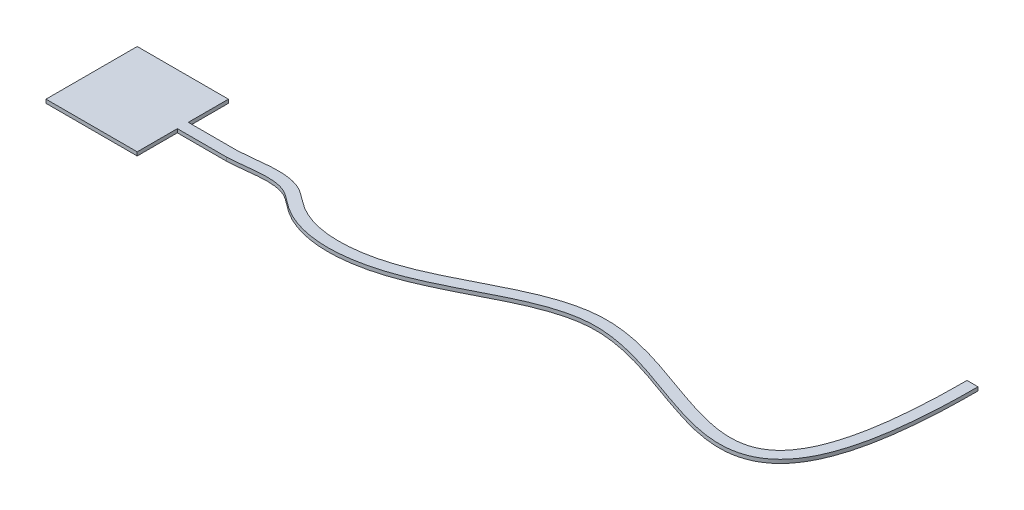
ISO-10303-21;
HEADER;
FILE_DESCRIPTION(('STEP AP214'),'2;1');
FILE_NAME('part.step','',(''),(''),'','','');
FILE_SCHEMA(('AUTOMOTIVE_DESIGN { 1 0 10303 214 1 1 1 1 }'));
ENDSEC;
DATA;
#1=APPLICATION_CONTEXT('core data for automotive mechanical design processes');
#2=APPLICATION_PROTOCOL_DEFINITION('international standard','automotive_design',2000,#1);
#3=PRODUCT_CONTEXT('',#1,'mechanical');
#4=PRODUCT('Part','Part','',(#3));
#5=PRODUCT_RELATED_PRODUCT_CATEGORY('part','',(#4));
#6=PRODUCT_DEFINITION_FORMATION('','',#4);
#7=PRODUCT_DEFINITION_CONTEXT('part definition',#1,'design');
#8=PRODUCT_DEFINITION('design','',#6,#7);
#9=PRODUCT_DEFINITION_SHAPE('','',#8);
#10=(LENGTH_UNIT() NAMED_UNIT(*) SI_UNIT(.MILLI.,.METRE.));
#11=(NAMED_UNIT(*) PLANE_ANGLE_UNIT() SI_UNIT($,.RADIAN.));
#12=(NAMED_UNIT(*) SI_UNIT($,.STERADIAN.) SOLID_ANGLE_UNIT());
#13=UNCERTAINTY_MEASURE_WITH_UNIT(LENGTH_MEASURE(1.E-05),#10,'distance_accuracy_value','');
#14=(GEOMETRIC_REPRESENTATION_CONTEXT(3) GLOBAL_UNCERTAINTY_ASSIGNED_CONTEXT((#13)) GLOBAL_UNIT_ASSIGNED_CONTEXT((#10,
#11,#12)) REPRESENTATION_CONTEXT('',''));
#15=CARTESIAN_POINT('',(0.,0.,0.));
#16=DIRECTION('',(0.,0.,1.));
#17=DIRECTION('',(1.,0.,0.));
#18=AXIS2_PLACEMENT_3D('',#15,#16,#17);
#19=CARTESIAN_POINT('',(90.1360544217688,10.,-116.496598639456));
#20=DIRECTION('',(-1.,0.,0.));
#21=DIRECTION('',(0.,0.,1.));
#22=AXIS2_PLACEMENT_3D('',#19,#20,#21);
#23=PLANE('',#22);
#24=DIRECTION('',(0.,1.,0.));
#25=VECTOR('',#24,1.);
#26=CARTESIAN_POINT('',(90.136054421769,0.,-6.49659863945584));
#27=LINE('',#26,#25);
#28=CARTESIAN_POINT('',(90.136054421769,0.,-6.49659863945584));
#29=VERTEX_POINT('',#28);
#30=CARTESIAN_POINT('',(90.136054421769,10.,-6.49659863945584));
#31=VERTEX_POINT('',#30);
#32=EDGE_CURVE('E188',#29,#31,#27,.T.);
#33=ORIENTED_EDGE('',*,*,#32,.F.);
#34=DIRECTION('',(0.,0.,-1.));
#35=VECTOR('',#34,1.);
#36=CARTESIAN_POINT('',(90.1360544217688,0.,-116.496598639456));
#37=LINE('',#36,#35);
#38=CARTESIAN_POINT('',(90.1360544217688,0.,-116.496598639456));
#39=VERTEX_POINT('',#38);
#40=EDGE_CURVE('E190',#29,#39,#37,.T.);
#41=ORIENTED_EDGE('',*,*,#40,.T.);
#42=DIRECTION('',(0.,-1.,0.));
#43=VECTOR('',#42,1.);
#44=CARTESIAN_POINT('',(90.1360544217688,10.,-116.496598639456));
#45=LINE('',#44,#43);
#46=CARTESIAN_POINT('',(90.1360544217688,10.,-116.496598639456));
#47=VERTEX_POINT('',#46);
#48=EDGE_CURVE('E209',#47,#39,#45,.T.);
#49=ORIENTED_EDGE('',*,*,#48,.F.);
#50=DIRECTION('',(0.,0.,-1.));
#51=VECTOR('',#50,1.);
#52=CARTESIAN_POINT('',(90.1360544217688,10.,-116.496598639456));
#53=LINE('',#52,#51);
#54=EDGE_CURVE('E191',#31,#47,#53,.T.);
#55=ORIENTED_EDGE('',*,*,#54,.F.);
#56=EDGE_LOOP('',(#33,#41,#49,#55));
#57=FACE_BOUND('',#56,.T.);
#58=ADVANCED_FACE('F35',(#57),#23,.F.);
#59=CARTESIAN_POINT('',(-159.863945578231,10.,-116.496598639456));
#60=DIRECTION('',(1.,0.,0.));
#61=DIRECTION('',(0.,0.,-1.));
#62=AXIS2_PLACEMENT_3D('',#59,#60,#61);
#63=PLANE('',#62);
#64=DIRECTION('',(0.,0.,1.));
#65=VECTOR('',#64,1.);
#66=CARTESIAN_POINT('',(-159.863945578231,0.,-116.496598639456));
#67=LINE('',#66,#65);
#68=CARTESIAN_POINT('',(-159.863945578231,0.,-116.496598639456));
#69=VERTEX_POINT('',#68);
#70=CARTESIAN_POINT('',(-159.863945578231,0.,133.503401360544));
#71=VERTEX_POINT('',#70);
#72=EDGE_CURVE('E201',#69,#71,#67,.T.);
#73=ORIENTED_EDGE('',*,*,#72,.T.);
#74=DIRECTION('',(0.,-1.,0.));
#75=VECTOR('',#74,1.);
#76=CARTESIAN_POINT('',(-159.863945578231,10.,133.503401360544));
#77=LINE('',#76,#75);
#78=CARTESIAN_POINT('',(-159.863945578231,10.,133.503401360544));
#79=VERTEX_POINT('',#78);
#80=EDGE_CURVE('E11',#79,#71,#77,.T.);
#81=ORIENTED_EDGE('',*,*,#80,.F.);
#82=DIRECTION('',(0.,0.,1.));
#83=VECTOR('',#82,1.);
#84=CARTESIAN_POINT('',(-159.863945578231,10.,-116.496598639456));
#85=LINE('',#84,#83);
#86=CARTESIAN_POINT('',(-159.863945578231,10.,-116.496598639456));
#87=VERTEX_POINT('',#86);
#88=EDGE_CURVE('E206',#87,#79,#85,.T.);
#89=ORIENTED_EDGE('',*,*,#88,.F.);
#90=DIRECTION('',(0.,-1.,0.));
#91=VECTOR('',#90,1.);
#92=CARTESIAN_POINT('',(-159.863945578231,10.,-116.496598639456));
#93=LINE('',#92,#91);
#94=EDGE_CURVE('E207',#87,#69,#93,.T.);
#95=ORIENTED_EDGE('',*,*,#94,.T.);
#96=EDGE_LOOP('',(#73,#81,#89,#95));
#97=FACE_BOUND('',#96,.T.);
#98=ADVANCED_FACE('F37',(#97),#63,.F.);
#99=CARTESIAN_POINT('',(-159.863945578231,10.,133.503401360544));
#100=DIRECTION('',(0.,0.,-1.));
#101=DIRECTION('',(-1.,0.,0.));
#102=AXIS2_PLACEMENT_3D('',#99,#100,#101);
#103=PLANE('',#102);
#104=DIRECTION('',(1.,0.,0.));
#105=VECTOR('',#104,1.);
#106=CARTESIAN_POINT('',(-159.863945578231,0.,133.503401360544));
#107=LINE('',#106,#105);
#108=CARTESIAN_POINT('',(90.1360544217688,0.,133.503401360544));
#109=VERTEX_POINT('',#108);
#110=EDGE_CURVE('E198',#71,#109,#107,.T.);
#111=ORIENTED_EDGE('',*,*,#110,.T.);
#112=DIRECTION('',(0.,-1.,0.));
#113=VECTOR('',#112,1.);
#114=CARTESIAN_POINT('',(90.1360544217688,10.,133.503401360544));
#115=LINE('',#114,#113);
#116=CARTESIAN_POINT('',(90.1360544217688,10.,133.503401360544));
#117=VERTEX_POINT('',#116);
#118=EDGE_CURVE('E43',#117,#109,#115,.T.);
#119=ORIENTED_EDGE('',*,*,#118,.F.);
#120=DIRECTION('',(1.,0.,0.));
#121=VECTOR('',#120,1.);
#122=CARTESIAN_POINT('',(-159.863945578231,10.,133.503401360544));
#123=LINE('',#122,#121);
#124=EDGE_CURVE('E87',#79,#117,#123,.T.);
#125=ORIENTED_EDGE('',*,*,#124,.F.);
#126=ORIENTED_EDGE('',*,*,#80,.T.);
#127=EDGE_LOOP('',(#111,#119,#125,#126));
#128=FACE_BOUND('',#127,.T.);
#129=ADVANCED_FACE('F175',(#128),#103,.F.);
#130=CARTESIAN_POINT('',(90.1360544217685,0.,23.5034013605442));
#131=VERTEX_POINT('',#130);
#132=EDGE_CURVE('E197',#109,#131,#37,.T.);
#133=ORIENTED_EDGE('',*,*,#132,.T.);
#134=DIRECTION('',(0.,1.,0.));
#135=VECTOR('',#134,1.);
#136=CARTESIAN_POINT('',(90.1360544217685,0.,23.5034013605442));
#137=LINE('',#136,#135);
#138=CARTESIAN_POINT('',(90.1360544217688,10.,23.5034013605442));
#139=VERTEX_POINT('',#138);
#140=EDGE_CURVE('E195',#131,#139,#137,.T.);
#141=ORIENTED_EDGE('',*,*,#140,.T.);
#142=EDGE_CURVE('E214',#117,#139,#53,.T.);
#143=ORIENTED_EDGE('',*,*,#142,.F.);
#144=ORIENTED_EDGE('',*,*,#118,.T.);
#145=EDGE_LOOP('',(#133,#141,#143,#144));
#146=FACE_BOUND('',#145,.T.);
#147=ADVANCED_FACE('F173',(#146),#23,.F.);
#148=CARTESIAN_POINT('',(-159.863945578231,10.,-116.496598639456));
#149=DIRECTION('',(0.,0.,1.));
#150=DIRECTION('',(1.,0.,0.));
#151=AXIS2_PLACEMENT_3D('',#148,#149,#150);
#152=PLANE('',#151);
#153=DIRECTION('',(-1.,0.,0.));
#154=VECTOR('',#153,1.);
#155=CARTESIAN_POINT('',(-159.863945578231,0.,-116.496598639456));
#156=LINE('',#155,#154);
#157=EDGE_CURVE('E80',#39,#69,#156,.T.);
#158=ORIENTED_EDGE('',*,*,#157,.T.);
#159=ORIENTED_EDGE('',*,*,#94,.F.);
#160=DIRECTION('',(-1.,0.,0.));
#161=VECTOR('',#160,1.);
#162=CARTESIAN_POINT('',(-159.863945578231,10.,-116.496598639456));
#163=LINE('',#162,#161);
#164=EDGE_CURVE('E59',#47,#87,#163,.T.);
#165=ORIENTED_EDGE('',*,*,#164,.F.);
#166=ORIENTED_EDGE('',*,*,#48,.T.);
#167=EDGE_LOOP('',(#158,#159,#165,#166));
#168=FACE_BOUND('',#167,.T.);
#169=ADVANCED_FACE('F168',(#168),#152,.F.);
#170=CARTESIAN_POINT('',(0.,10.,0.));
#171=DIRECTION('',(0.,1.,0.));
#172=DIRECTION('',(0.,0.,1.));
#173=AXIS2_PLACEMENT_3D('',#170,#171,#172);
#174=PLANE('',#173);
#175=ORIENTED_EDGE('',*,*,#88,.T.);
#176=ORIENTED_EDGE('',*,*,#124,.T.);
#177=ORIENTED_EDGE('',*,*,#142,.T.);
#178=DIRECTION('',(1.,0.,0.));
#179=VECTOR('',#178,1.);
#180=CARTESIAN_POINT('',(90.1360544217685,10.,23.5034013605442));
#181=LINE('',#180,#179);
#182=CARTESIAN_POINT('',(224.598505458622,10.,23.5034013605442));
#183=VERTEX_POINT('',#182);
#184=EDGE_CURVE('E50',#139,#183,#181,.T.);
#185=ORIENTED_EDGE('',*,*,#184,.T.);
#186=CARTESIAN_POINT('',(224.598505458622,10.,23.5034013605442));
#187=CARTESIAN_POINT('',(224.908041880864,10.,23.4921839566827));
#188=CARTESIAN_POINT('',(225.522573011471,10.,23.4697558428933));
#189=CARTESIAN_POINT('',(226.787755953539,10.,23.419030541642));
#190=CARTESIAN_POINT('',(228.987501266859,10.,23.3209105847382));
#191=CARTESIAN_POINT('',(233.406551089768,10.,23.0850552852588));
#192=CARTESIAN_POINT('',(242.264505540642,10.,22.4727970725493));
#193=CARTESIAN_POINT('',(254.982003606531,10.,21.2788356940378));
#194=CARTESIAN_POINT('',(270.256335123547,10.,19.5903987865844));
#195=CARTESIAN_POINT('',(290.517505272654,10.,17.3215236607874));
#196=CARTESIAN_POINT('',(315.389033429307,10.,15.0435797239001));
#197=CARTESIAN_POINT('',(338.832631869599,10.,14.9891707033856));
#198=CARTESIAN_POINT('',(356.210386122414,10.,17.0290797020259));
#199=CARTESIAN_POINT('',(368.443241935866,10.,19.7434718081098));
#200=CARTESIAN_POINT('',(377.956332894955,10.,23.1246279092575));
#201=CARTESIAN_POINT('',(385.0989353298,10.,26.5468956410943));
#202=CARTESIAN_POINT('',(392.186511952391,10.,30.6076182876203));
#203=CARTESIAN_POINT('',(401.314719239079,10.,36.9116569854145));
#204=CARTESIAN_POINT('',(412.746876688108,10.,45.7441752287583));
#205=CARTESIAN_POINT('',(422.90893517784,10.,53.5269769028258));
#206=CARTESIAN_POINT('',(431.652275172028,10.,59.5736458838501));
#207=CARTESIAN_POINT('',(440.552908646127,10.,65.2297797098994));
#208=CARTESIAN_POINT('',(452.000971117987,10.,71.649905562016));
#209=CARTESIAN_POINT('',(470.907542457307,10.,80.5497662285239));
#210=CARTESIAN_POINT('',(495.512333252508,10.,89.2062894846528));
#211=CARTESIAN_POINT('',(526.171917509746,10.,95.9550717423305));
#212=CARTESIAN_POINT('',(557.592937415357,10.,99.3878852950747));
#213=CARTESIAN_POINT('',(589.428345640132,10.,99.8152466814699));
#214=CARTESIAN_POINT('',(631.994680784874,10.,96.7756098419113));
#215=CARTESIAN_POINT('',(684.56803839332,10.,86.9000011634768));
#216=CARTESIAN_POINT('',(744.291054451803,10.,67.5679722553177));
#217=CARTESIAN_POINT('',(801.360344457355,10.,43.1962464049354));
#218=CARTESIAN_POINT('',(856.322445706707,10.,16.1061165511953));
#219=CARTESIAN_POINT('',(909.759621842759,10.,-11.4273770684462));
#220=CARTESIAN_POINT('',(962.189603916106,10.,-37.1739617305193));
#221=CARTESIAN_POINT('',(1014.07903484937,10.,-58.9505289300414));
#222=CARTESIAN_POINT('',(1057.22449411161,10.,-72.0427435090701));
#223=CARTESIAN_POINT('',(1091.93745789949,10.,-78.5027867087507));
#224=CARTESIAN_POINT('',(1113.78085979771,10.,-80.6772376505434));
#225=CARTESIAN_POINT('',(1131.41063215384,10.,-81.1723796042944));
#226=CARTESIAN_POINT('',(1149.26253542193,10.,-80.8597618191108));
#227=CARTESIAN_POINT('',(1171.92531540311,10.,-79.0432846667345));
#228=CARTESIAN_POINT('',(1199.60378639099,10.,-74.8439367700824));
#229=CARTESIAN_POINT('',(1237.01651064643,10.,-66.9224844999241));
#230=CARTESIAN_POINT('',(1284.4839388293,10.,-53.3805925311954));
#231=CARTESIAN_POINT('',(1341.78488222546,10.,-33.6898856946803));
#232=CARTESIAN_POINT('',(1398.71649709208,10.,-13.0066581535393));
#233=CARTESIAN_POINT('',(1454.65416648947,10.,6.19502811218525));
#234=CARTESIAN_POINT('',(1509.07836467535,10.,21.4079975982107));
#235=CARTESIAN_POINT('',(1561.59954526204,10.,30.0255164005324));
#236=CARTESIAN_POINT('',(1611.92572146882,10.,29.1773747277627));
#237=CARTESIAN_POINT('',(1651.43225157519,10.,17.7300084665269));
#238=CARTESIAN_POINT('',(1680.52055205157,10.,0.642098503979991));
#239=CARTESIAN_POINT('',(1707.51384164231,10.,-21.9704682017199));
#240=CARTESIAN_POINT('',(1730.93588796128,10.,-53.0902514173489));
#241=CARTESIAN_POINT('',(1750.60531576553,10.,-93.396640012908));
#242=CARTESIAN_POINT('',(1763.50692761305,10.,-128.508027782976));
#243=CARTESIAN_POINT('',(1774.54885320693,10.,-168.80862276368));
#244=CARTESIAN_POINT('',(1782.1816553521,10.,-206.993903293286));
#245=CARTESIAN_POINT('',(1787.32528051089,10.,-240.471222262615));
#246=CARTESIAN_POINT('',(1790.69500028404,10.,-267.085860216187));
#247=CARTESIAN_POINT('',(1793.56954429972,10.,-295.249059517238));
#248=CARTESIAN_POINT('',(1795.94111076834,10.,-325.0025589159));
#249=CARTESIAN_POINT('',(1797.4913932195,10.,-351.156936609844));
#250=CARTESIAN_POINT('',(1798.4716849389,10.,-372.917032874849));
#251=CARTESIAN_POINT('',(1799.07582409563,10.,-389.660315408096));
#252=CARTESIAN_POINT('',(1799.54775926388,10.,-406.832830641904));
#253=CARTESIAN_POINT('',(1799.88634919608,10.,-424.436314877019));
#254=CARTESIAN_POINT('',(1800.05642424441,10.,-439.479768152551));
#255=CARTESIAN_POINT('',(1800.12465057264,10.,-451.717901202416));
#256=CARTESIAN_POINT('',(1800.13605442177,10.,-457.945117946387));
#257=CARTESIAN_POINT('',(1800.13605442177,10.,-461.045215383941));
#258=B_SPLINE_CURVE_WITH_KNOTS('',3,(#186,#187,#188,#189,#190,#191,#192,#193,#194,#195,#196,
#197,#198,#199,#200,#201,#202,#203,#204,#205,#206,#207,#208,#209,#210,#211,#212,#213,#214,#215,
#216,#217,#218,#219,#220,#221,#222,#223,#224,#225,#226,#227,#228,#229,#230,#231,#232,#233,#234,
#235,#236,#237,#238,#239,#240,#241,#242,#243,#244,#245,#246,#247,#248,#249,#250,#251,#252,#253,
#254,#255,#256,#257),.UNSPECIFIED.,.F.,.F.,(4,1,1,1,1,1,1,1,1,1,1,1,1,1,1,1,1,1,1,1,1,1,1,1,1,1,
1,1,1,1,1,1,1,1,1,1,1,1,1,1,1,1,1,1,1,1,1,1,1,1,1,1,1,1,1,1,1,1,1,1,1,1,1,1,1,1,1,1,1,4),
(-0.000148145044158577,0.000340208542288766,0.000828562128736109,0.00180526930163079,
0.00375868364742017,0.00766551233899891,0.0154791697221564,0.0232928271053139,
0.0311064844884714,0.0467337992547864,0.0623611140211013,0.0701747714042588,0.0779884287874163,
0.0858020861705738,0.0897089148621525,0.0936157435537313,0.101429400936889,0.109243058320046,
0.117056715703204,0.120963544394782,0.124870373086361,0.132684030469519,0.140497687852676,
0.156125002618991,0.171752317385306,0.187379632151621,0.203006946917936,0.218634261684251,
0.249888891216881,0.281143520749511,0.312398150282141,0.343652779814771,0.374907409347401,
0.406162038880031,0.437416668412661,0.468671297945291,0.484298612711606,0.499925927477921,
0.507739584861078,0.515553242244236,0.531180557010551,0.546807871776866,0.562435186543181,
0.593689816075811,0.624944445608441,0.65619907514107,0.6874537046737,0.71870833420633,
0.74996296373896,0.78121759327159,0.81247222280422,0.828099537570535,0.84372685233685,
0.87498148186948,0.890608796635795,0.90623611140211,0.921863426168425,0.93749074093474,
0.945304398317897,0.953118055701055,0.960931713084213,0.96874537046737,0.976559027850528,
0.980465856542106,0.984372685233685,0.988279513925264,0.992186342616842,0.996093171308421,
0.998046585654211,1.),.UNSPECIFIED.);
#259=CARTESIAN_POINT('',(1800.13605442177,10.,-461.045215383941));
#260=VERTEX_POINT('',#259);
#261=EDGE_CURVE('E149',#183,#260,#258,.T.);
#262=ORIENTED_EDGE('',*,*,#261,.T.);
#263=DIRECTION('',(-1.,0.,0.));
#264=VECTOR('',#263,1.);
#265=CARTESIAN_POINT('',(1785.13605442177,10.,-461.045215383941));
#266=LINE('',#265,#264);
#267=CARTESIAN_POINT('',(1770.13605442177,10.,-461.045215383941));
#268=VERTEX_POINT('',#267);
#269=EDGE_CURVE('E147',#260,#268,#266,.T.);
#270=ORIENTED_EDGE('',*,*,#269,.T.);
#271=CARTESIAN_POINT('',(1770.13605442177,10.,-461.045215383941));
#272=CARTESIAN_POINT('',(1770.13605442177,10.,-457.982966398618));
#273=CARTESIAN_POINT('',(1770.12479104371,10.,-451.830930601434));
#274=CARTESIAN_POINT('',(1770.05743986616,10.,-439.747285483339));
#275=CARTESIAN_POINT('',(1769.88963579194,10.,-424.90199979654));
#276=CARTESIAN_POINT('',(1769.55587432041,10.,-407.545755728651));
#277=CARTESIAN_POINT('',(1769.09111673937,10.,-390.630171456468));
#278=CARTESIAN_POINT('',(1768.49677689612,10.,-374.154087984293));
#279=CARTESIAN_POINT('',(1767.53345503781,10.,-352.764649287711));
#280=CARTESIAN_POINT('',(1766.01253023214,10.,-327.101996500555));
#281=CARTESIAN_POINT('',(1763.69238343956,10.,-297.988890918706));
#282=CARTESIAN_POINT('',(1760.88938974564,10.,-270.521770886312));
#283=CARTESIAN_POINT('',(1757.6161839605,10.,-244.664707489581));
#284=CARTESIAN_POINT('',(1752.64265276793,10.,-212.287747479565));
#285=CARTESIAN_POINT('',(1745.31767042148,10.,-175.663478824009));
#286=CARTESIAN_POINT('',(1734.87596889596,10.,-137.585139369271));
#287=CARTESIAN_POINT('',(1722.92181287971,10.,-105.087756617901));
#288=CARTESIAN_POINT('',(1709.61424501131,10.,-77.8625702876427));
#289=CARTESIAN_POINT('',(1695.12450100062,10.,-55.5594975402587));
#290=CARTESIAN_POINT('',(1679.60751855774,10.,-37.7630101998823));
#291=CARTESIAN_POINT('',(1663.14509857353,10.,-23.9867502654848));
#292=CARTESIAN_POINT('',(1639.89142770839,10.,-10.3206114985481));
#293=CARTESIAN_POINT('',(1607.99678431613,10.,-0.936566815800003));
#294=CARTESIAN_POINT('',(1564.39414168818,10.,0.00370451415344979));
#295=CARTESIAN_POINT('',(1516.04415378564,10.,-7.83001779484303));
#296=CARTESIAN_POINT('',(1463.96299142229,10.,-22.3401419291884));
#297=CARTESIAN_POINT('',(1409.06948698843,10.,-41.1648938889938));
#298=CARTESIAN_POINT('',(1352.1525889543,10.,-61.8427997854481));
#299=CARTESIAN_POINT('',(1293.89655691902,10.,-81.8792842773726));
#300=CARTESIAN_POINT('',(1244.732352248,10.,-95.941027531969));
#301=CARTESIAN_POINT('',(1205.29575179849,10.,-104.317384994584));
#302=CARTESIAN_POINT('',(1175.72326148828,10.,-108.826615840398));
#303=CARTESIAN_POINT('',(1146.23959928768,10.,-111.224713672862));
#304=CARTESIAN_POINT('',(1116.85045911895,10.,-111.133372290147));
#305=CARTESIAN_POINT('',(1087.92692482029,10.,-108.270788726829));
#306=CARTESIAN_POINT('',(1050.08270950338,10.,-101.249840130734));
#307=CARTESIAN_POINT('',(1003.93964977809,10.,-87.2398959473903));
#308=CARTESIAN_POINT('',(949.865718642134,10.,-64.5442015944629));
#309=CARTESIAN_POINT('',(896.425833844694,10.,-38.3043650273838));
#310=CARTESIAN_POINT('',(843.001247771835,10.,-10.7772159812192));
#311=CARTESIAN_POINT('',(789.025767700891,10.,15.8298705070783));
#312=CARTESIAN_POINT('',(743.160345809762,10.,35.4299378443617));
#313=CARTESIAN_POINT('',(705.682960639707,10.,48.5134068185904));
#314=CARTESIAN_POINT('',(677.129152957546,10.,56.7722838709652));
#315=CARTESIAN_POINT('',(648.009037616359,10.,63.2247310849899));
#316=CARTESIAN_POINT('',(618.479339100366,10.,67.6397043191332));
#317=CARTESIAN_POINT('',(588.961891458809,10.,69.7796621267665));
#318=CARTESIAN_POINT('',(559.817790090317,10.,69.421341068283));
#319=CARTESIAN_POINT('',(531.417966591625,10.,66.3546995589004));
#320=CARTESIAN_POINT('',(504.113585769054,10.,60.3842743324288));
#321=CARTESIAN_POINT('',(482.544732997902,10.,52.8357311256116));
#322=CARTESIAN_POINT('',(466.138186643629,10.,45.1560585867213));
#323=CARTESIAN_POINT('',(456.268327380405,10.,39.652778945929));
#324=CARTESIAN_POINT('',(448.603557680878,10.,34.8069564015181));
#325=CARTESIAN_POINT('',(441.143802264698,10.,29.6816360424605));
#326=CARTESIAN_POINT('',(431.652203277592,10.,22.4489118810332));
#327=CARTESIAN_POINT('',(419.715016726117,10.,13.2007479669079));
#328=CARTESIAN_POINT('',(408.986196797023,10.,5.69850654167985));
#329=CARTESIAN_POINT('',(399.628616591134,10.,0.264277531324219));
#330=CARTESIAN_POINT('',(389.786310439922,10.,-4.51844210163076));
#331=CARTESIAN_POINT('',(377.177361099167,10.,-9.03782156697889));
#332=CARTESIAN_POINT('',(361.644202974977,10.,-12.5323387854737));
#333=CARTESIAN_POINT('',(345.910588472735,10.,-14.4118308844668));
#334=CARTESIAN_POINT('',(330.075530364553,10.,-15.0083549019554));
#335=CARTESIAN_POINT('',(314.227760619612,10.,-14.6216727500649));
#336=CARTESIAN_POINT('',(298.44735570544,10.,-13.5317647450887));
#337=CARTESIAN_POINT('',(282.820235818958,10.,-12.0016175222158));
#338=CARTESIAN_POINT('',(267.44158066189,10.,-10.2827725821006));
#339=CARTESIAN_POINT('',(254.921612026916,10.,-8.89546964544585));
#340=CARTESIAN_POINT('',(245.143318243952,10.,-7.9296597962652));
#341=CARTESIAN_POINT('',(237.943470260863,10.,-7.30544865408611));
#342=CARTESIAN_POINT('',(232.073765837747,10.,-6.89183804599627));
#343=CARTESIAN_POINT('',(227.454963813921,10.,-6.63771966276073));
#344=CARTESIAN_POINT('',(225.18987541344,10.,-6.53900333134646));
#345=CARTESIAN_POINT('',(224.051368882514,10.,-6.49659863945584));
#346=B_SPLINE_CURVE_WITH_KNOTS('',3,(#271,#272,#273,#274,#275,#276,#277,#278,#279,#280,#281,
#282,#283,#284,#285,#286,#287,#288,#289,#290,#291,#292,#293,#294,#295,#296,#297,#298,#299,#300,
#301,#302,#303,#304,#305,#306,#307,#308,#309,#310,#311,#312,#313,#314,#315,#316,#317,#318,#319,
#320,#321,#322,#323,#324,#325,#326,#327,#328,#329,#330,#331,#332,#333,#334,#335,#336,#337,#338,
#339,#340,#341,#342,#343,#344,#345),.UNSPECIFIED.,.F.,.F.,(4,1,1,1,1,1,1,1,1,1,1,1,1,1,1,1,1,1,
1,1,1,1,1,1,1,1,1,1,1,1,1,1,1,1,1,1,1,1,1,1,1,1,1,1,1,1,1,1,1,1,1,1,1,1,1,1,1,1,1,1,1,1,1,1,1,1,
1,1,1,1,1,1,4),(0.000154285060482352,0.00210710872247358,0.00405993238446482,
0.00796557970844728,0.0118712270324297,0.0157768743564123,0.0196825216803949,0.0235881690043774,
0.0313994636523423,0.0392107583003072,0.0470220529482723,0.0548333475962373,0.0626446422442022,
0.0782672315401322,0.0938898208360621,0.109512410131992,0.125134999427922,0.140757588723852,
0.156380178019782,0.172002767315712,0.187625356611642,0.218870535203502,0.250115713795362,
0.281360892387222,0.312606070979082,0.343851249570942,0.375096428162802,0.406341606754662,
0.437586785346521,0.453209374642451,0.468831963938381,0.484454553234311,0.500077142530241,
0.515699731826171,0.531322321122101,0.562567499713961,0.593812678305821,0.625057856897681,
0.656303035489541,0.687548214081401,0.718793392673261,0.734415981969191,0.750038571265121,
0.765661160561051,0.78128374985698,0.796906339152911,0.81252892844884,0.82815151774477,
0.8437741070407,0.85939669633663,0.867207990984595,0.87501928563256,0.878924932956543,
0.882830580280525,0.89064187492849,0.898453169576455,0.90626446422442,0.910170111548403,
0.914075758872385,0.92188705352035,0.929698348168315,0.93750964281628,0.945320937464245,
0.95313223211221,0.960943526760175,0.96875482140814,0.976566116056105,0.98437741070407,
0.988283058028052,0.992188705352035,0.996094352676017,0.998047176338009,1.),.UNSPECIFIED.);
#347=CARTESIAN_POINT('',(224.051368882514,10.,-6.49659863945584));
#348=VERTEX_POINT('',#347);
#349=EDGE_CURVE('E127',#268,#348,#346,.T.);
#350=ORIENTED_EDGE('',*,*,#349,.T.);
#351=DIRECTION('',(-1.,0.,0.));
#352=VECTOR('',#351,1.);
#353=CARTESIAN_POINT('',(90.136054421769,10.,-6.49659863945584));
#354=LINE('',#353,#352);
#355=EDGE_CURVE('E241',#348,#31,#354,.T.);
#356=ORIENTED_EDGE('',*,*,#355,.T.);
#357=ORIENTED_EDGE('',*,*,#54,.T.);
#358=ORIENTED_EDGE('',*,*,#164,.T.);
#359=EDGE_LOOP('',(#175,#176,#177,#185,#262,#270,#350,#356,#357,#358));
#360=FACE_BOUND('',#359,.T.);
#361=ADVANCED_FACE('F165',(#360),#174,.T.);
#362=CARTESIAN_POINT('',(0.,0.,0.));
#363=DIRECTION('',(0.,1.,0.));
#364=DIRECTION('',(0.,0.,1.));
#365=AXIS2_PLACEMENT_3D('',#362,#363,#364);
#366=PLANE('',#365);
#367=ORIENTED_EDGE('',*,*,#72,.F.);
#368=ORIENTED_EDGE('',*,*,#157,.F.);
#369=ORIENTED_EDGE('',*,*,#40,.F.);
#370=DIRECTION('',(-1.,0.,0.));
#371=VECTOR('',#370,1.);
#372=CARTESIAN_POINT('',(90.136054421769,0.,-6.49659863945584));
#373=LINE('',#372,#371);
#374=CARTESIAN_POINT('',(224.051368882514,0.,-6.49659863945584));
#375=VERTEX_POINT('',#374);
#376=EDGE_CURVE('E142',#375,#29,#373,.T.);
#377=ORIENTED_EDGE('',*,*,#376,.F.);
#378=CARTESIAN_POINT('',(1770.13605442177,0.,-461.045215383941));
#379=CARTESIAN_POINT('',(1770.13605442177,0.,-457.982966398618));
#380=CARTESIAN_POINT('',(1770.12479104371,0.,-451.830930601434));
#381=CARTESIAN_POINT('',(1770.05743986616,0.,-439.747285483339));
#382=CARTESIAN_POINT('',(1769.88963579194,0.,-424.90199979654));
#383=CARTESIAN_POINT('',(1769.55587432041,0.,-407.545755728651));
#384=CARTESIAN_POINT('',(1769.09111673937,0.,-390.630171456468));
#385=CARTESIAN_POINT('',(1768.49677689612,0.,-374.154087984293));
#386=CARTESIAN_POINT('',(1767.53345503781,0.,-352.764649287711));
#387=CARTESIAN_POINT('',(1766.01253023214,0.,-327.101996500555));
#388=CARTESIAN_POINT('',(1763.69238343956,0.,-297.988890918706));
#389=CARTESIAN_POINT('',(1760.88938974564,0.,-270.521770886312));
#390=CARTESIAN_POINT('',(1757.6161839605,0.,-244.664707489581));
#391=CARTESIAN_POINT('',(1752.64265276793,0.,-212.287747479565));
#392=CARTESIAN_POINT('',(1745.31767042148,0.,-175.663478824009));
#393=CARTESIAN_POINT('',(1734.87596889596,0.,-137.585139369271));
#394=CARTESIAN_POINT('',(1722.92181287971,0.,-105.087756617901));
#395=CARTESIAN_POINT('',(1709.61424501131,0.,-77.8625702876427));
#396=CARTESIAN_POINT('',(1695.12450100062,0.,-55.5594975402587));
#397=CARTESIAN_POINT('',(1679.60751855774,0.,-37.7630101998823));
#398=CARTESIAN_POINT('',(1663.14509857353,0.,-23.9867502654848));
#399=CARTESIAN_POINT('',(1639.89142770839,0.,-10.3206114985481));
#400=CARTESIAN_POINT('',(1607.99678431613,0.,-0.936566815800003));
#401=CARTESIAN_POINT('',(1564.39414168818,0.,0.00370451415344979));
#402=CARTESIAN_POINT('',(1516.04415378564,0.,-7.83001779484303));
#403=CARTESIAN_POINT('',(1463.96299142229,0.,-22.3401419291884));
#404=CARTESIAN_POINT('',(1409.06948698843,0.,-41.1648938889938));
#405=CARTESIAN_POINT('',(1352.1525889543,0.,-61.8427997854481));
#406=CARTESIAN_POINT('',(1293.89655691902,0.,-81.8792842773726));
#407=CARTESIAN_POINT('',(1244.732352248,0.,-95.941027531969));
#408=CARTESIAN_POINT('',(1205.29575179849,0.,-104.317384994584));
#409=CARTESIAN_POINT('',(1175.72326148828,0.,-108.826615840398));
#410=CARTESIAN_POINT('',(1146.23959928768,0.,-111.224713672862));
#411=CARTESIAN_POINT('',(1116.85045911895,0.,-111.133372290147));
#412=CARTESIAN_POINT('',(1087.92692482029,0.,-108.270788726829));
#413=CARTESIAN_POINT('',(1050.08270950338,0.,-101.249840130734));
#414=CARTESIAN_POINT('',(1003.93964977809,0.,-87.2398959473903));
#415=CARTESIAN_POINT('',(949.865718642134,0.,-64.5442015944629));
#416=CARTESIAN_POINT('',(896.425833844694,0.,-38.3043650273838));
#417=CARTESIAN_POINT('',(843.001247771835,0.,-10.7772159812192));
#418=CARTESIAN_POINT('',(789.025767700891,0.,15.8298705070783));
#419=CARTESIAN_POINT('',(743.160345809762,0.,35.4299378443617));
#420=CARTESIAN_POINT('',(705.682960639707,0.,48.5134068185904));
#421=CARTESIAN_POINT('',(677.129152957546,0.,56.7722838709652));
#422=CARTESIAN_POINT('',(648.009037616359,0.,63.2247310849899));
#423=CARTESIAN_POINT('',(618.479339100366,0.,67.6397043191332));
#424=CARTESIAN_POINT('',(588.961891458809,0.,69.7796621267665));
#425=CARTESIAN_POINT('',(559.817790090317,0.,69.421341068283));
#426=CARTESIAN_POINT('',(531.417966591625,0.,66.3546995589004));
#427=CARTESIAN_POINT('',(504.113585769054,0.,60.3842743324288));
#428=CARTESIAN_POINT('',(482.544732997902,0.,52.8357311256116));
#429=CARTESIAN_POINT('',(466.138186643629,0.,45.1560585867213));
#430=CARTESIAN_POINT('',(456.268327380405,0.,39.652778945929));
#431=CARTESIAN_POINT('',(448.603557680878,0.,34.8069564015181));
#432=CARTESIAN_POINT('',(441.143802264698,0.,29.6816360424605));
#433=CARTESIAN_POINT('',(431.652203277592,0.,22.4489118810332));
#434=CARTESIAN_POINT('',(419.715016726117,0.,13.2007479669079));
#435=CARTESIAN_POINT('',(408.986196797023,0.,5.69850654167985));
#436=CARTESIAN_POINT('',(399.628616591134,0.,0.264277531324219));
#437=CARTESIAN_POINT('',(389.786310439922,0.,-4.51844210163076));
#438=CARTESIAN_POINT('',(377.177361099167,0.,-9.03782156697889));
#439=CARTESIAN_POINT('',(361.644202974977,0.,-12.5323387854737));
#440=CARTESIAN_POINT('',(345.910588472735,0.,-14.4118308844668));
#441=CARTESIAN_POINT('',(330.075530364553,0.,-15.0083549019554));
#442=CARTESIAN_POINT('',(314.227760619612,0.,-14.6216727500649));
#443=CARTESIAN_POINT('',(298.44735570544,0.,-13.5317647450887));
#444=CARTESIAN_POINT('',(282.820235818958,0.,-12.0016175222158));
#445=CARTESIAN_POINT('',(267.44158066189,0.,-10.2827725821006));
#446=CARTESIAN_POINT('',(254.921612026916,0.,-8.89546964544585));
#447=CARTESIAN_POINT('',(245.143318243952,0.,-7.9296597962652));
#448=CARTESIAN_POINT('',(237.943470260863,0.,-7.30544865408611));
#449=CARTESIAN_POINT('',(232.073765837747,0.,-6.89183804599627));
#450=CARTESIAN_POINT('',(227.454963813921,0.,-6.63771966276073));
#451=CARTESIAN_POINT('',(225.18987541344,0.,-6.53900333134646));
#452=CARTESIAN_POINT('',(224.051368882514,0.,-6.49659863945584));
#453=B_SPLINE_CURVE_WITH_KNOTS('',3,(#378,#379,#380,#381,#382,#383,#384,#385,#386,#387,#388,
#389,#390,#391,#392,#393,#394,#395,#396,#397,#398,#399,#400,#401,#402,#403,#404,#405,#406,#407,
#408,#409,#410,#411,#412,#413,#414,#415,#416,#417,#418,#419,#420,#421,#422,#423,#424,#425,#426,
#427,#428,#429,#430,#431,#432,#433,#434,#435,#436,#437,#438,#439,#440,#441,#442,#443,#444,#445,
#446,#447,#448,#449,#450,#451,#452),.UNSPECIFIED.,.F.,.F.,(4,1,1,1,1,1,1,1,1,1,1,1,1,1,1,1,1,1,
1,1,1,1,1,1,1,1,1,1,1,1,1,1,1,1,1,1,1,1,1,1,1,1,1,1,1,1,1,1,1,1,1,1,1,1,1,1,1,1,1,1,1,1,1,1,1,1,
1,1,1,1,1,1,4),(0.000154285060482352,0.00210710872247358,0.00405993238446482,
0.00796557970844728,0.0118712270324297,0.0157768743564123,0.0196825216803949,0.0235881690043774,
0.0313994636523423,0.0392107583003072,0.0470220529482723,0.0548333475962373,0.0626446422442022,
0.0782672315401322,0.0938898208360621,0.109512410131992,0.125134999427922,0.140757588723852,
0.156380178019782,0.172002767315712,0.187625356611642,0.218870535203502,0.250115713795362,
0.281360892387222,0.312606070979082,0.343851249570942,0.375096428162802,0.406341606754662,
0.437586785346521,0.453209374642451,0.468831963938381,0.484454553234311,0.500077142530241,
0.515699731826171,0.531322321122101,0.562567499713961,0.593812678305821,0.625057856897681,
0.656303035489541,0.687548214081401,0.718793392673261,0.734415981969191,0.750038571265121,
0.765661160561051,0.78128374985698,0.796906339152911,0.81252892844884,0.82815151774477,
0.8437741070407,0.85939669633663,0.867207990984595,0.87501928563256,0.878924932956543,
0.882830580280525,0.89064187492849,0.898453169576455,0.90626446422442,0.910170111548403,
0.914075758872385,0.92188705352035,0.929698348168315,0.93750964281628,0.945320937464245,
0.95313223211221,0.960943526760175,0.96875482140814,0.976566116056105,0.98437741070407,
0.988283058028052,0.992188705352035,0.996094352676017,0.998047176338009,1.),.UNSPECIFIED.);
#454=CARTESIAN_POINT('',(1770.13605442177,0.,-461.045215383941));
#455=VERTEX_POINT('',#454);
#456=EDGE_CURVE('E125',#455,#375,#453,.T.);
#457=ORIENTED_EDGE('',*,*,#456,.F.);
#458=DIRECTION('',(-1.,0.,0.));
#459=VECTOR('',#458,1.);
#460=CARTESIAN_POINT('',(1785.13605442177,0.,-461.045215383941));
#461=LINE('',#460,#459);
#462=CARTESIAN_POINT('',(1800.13605442177,0.,-461.045215383941));
#463=VERTEX_POINT('',#462);
#464=EDGE_CURVE('E139',#463,#455,#461,.T.);
#465=ORIENTED_EDGE('',*,*,#464,.F.);
#466=CARTESIAN_POINT('',(224.598505458622,0.,23.5034013605442));
#467=CARTESIAN_POINT('',(224.908041880864,0.,23.4921839566827));
#468=CARTESIAN_POINT('',(225.522573011471,0.,23.4697558428933));
#469=CARTESIAN_POINT('',(226.787755953539,0.,23.419030541642));
#470=CARTESIAN_POINT('',(228.987501266859,0.,23.3209105847382));
#471=CARTESIAN_POINT('',(233.406551089768,0.,23.0850552852588));
#472=CARTESIAN_POINT('',(242.264505540642,0.,22.4727970725493));
#473=CARTESIAN_POINT('',(254.982003606531,0.,21.2788356940378));
#474=CARTESIAN_POINT('',(270.256335123547,0.,19.5903987865844));
#475=CARTESIAN_POINT('',(290.517505272654,0.,17.3215236607874));
#476=CARTESIAN_POINT('',(315.389033429307,0.,15.0435797239001));
#477=CARTESIAN_POINT('',(338.832631869599,0.,14.9891707033856));
#478=CARTESIAN_POINT('',(356.210386122414,0.,17.0290797020259));
#479=CARTESIAN_POINT('',(368.443241935866,0.,19.7434718081098));
#480=CARTESIAN_POINT('',(377.956332894955,0.,23.1246279092575));
#481=CARTESIAN_POINT('',(385.0989353298,0.,26.5468956410943));
#482=CARTESIAN_POINT('',(392.186511952391,0.,30.6076182876203));
#483=CARTESIAN_POINT('',(401.314719239079,0.,36.9116569854145));
#484=CARTESIAN_POINT('',(412.746876688108,0.,45.7441752287583));
#485=CARTESIAN_POINT('',(422.90893517784,0.,53.5269769028258));
#486=CARTESIAN_POINT('',(431.652275172028,0.,59.5736458838501));
#487=CARTESIAN_POINT('',(440.552908646127,0.,65.2297797098994));
#488=CARTESIAN_POINT('',(452.000971117987,0.,71.649905562016));
#489=CARTESIAN_POINT('',(470.907542457307,0.,80.5497662285239));
#490=CARTESIAN_POINT('',(495.512333252508,0.,89.2062894846528));
#491=CARTESIAN_POINT('',(526.171917509746,0.,95.9550717423305));
#492=CARTESIAN_POINT('',(557.592937415357,0.,99.3878852950747));
#493=CARTESIAN_POINT('',(589.428345640132,0.,99.8152466814699));
#494=CARTESIAN_POINT('',(631.994680784874,0.,96.7756098419113));
#495=CARTESIAN_POINT('',(684.56803839332,0.,86.9000011634768));
#496=CARTESIAN_POINT('',(744.291054451803,0.,67.5679722553177));
#497=CARTESIAN_POINT('',(801.360344457355,0.,43.1962464049354));
#498=CARTESIAN_POINT('',(856.322445706707,0.,16.1061165511953));
#499=CARTESIAN_POINT('',(909.759621842759,0.,-11.4273770684462));
#500=CARTESIAN_POINT('',(962.189603916106,0.,-37.1739617305193));
#501=CARTESIAN_POINT('',(1014.07903484937,0.,-58.9505289300414));
#502=CARTESIAN_POINT('',(1057.22449411161,0.,-72.0427435090701));
#503=CARTESIAN_POINT('',(1091.93745789949,0.,-78.5027867087507));
#504=CARTESIAN_POINT('',(1113.78085979771,0.,-80.6772376505434));
#505=CARTESIAN_POINT('',(1131.41063215384,0.,-81.1723796042944));
#506=CARTESIAN_POINT('',(1149.26253542193,0.,-80.8597618191108));
#507=CARTESIAN_POINT('',(1171.92531540311,0.,-79.0432846667345));
#508=CARTESIAN_POINT('',(1199.60378639099,0.,-74.8439367700824));
#509=CARTESIAN_POINT('',(1237.01651064643,0.,-66.9224844999241));
#510=CARTESIAN_POINT('',(1284.4839388293,0.,-53.3805925311954));
#511=CARTESIAN_POINT('',(1341.78488222546,0.,-33.6898856946803));
#512=CARTESIAN_POINT('',(1398.71649709208,0.,-13.0066581535393));
#513=CARTESIAN_POINT('',(1454.65416648947,0.,6.19502811218525));
#514=CARTESIAN_POINT('',(1509.07836467535,0.,21.4079975982107));
#515=CARTESIAN_POINT('',(1561.59954526204,0.,30.0255164005324));
#516=CARTESIAN_POINT('',(1611.92572146882,0.,29.1773747277627));
#517=CARTESIAN_POINT('',(1651.43225157519,0.,17.7300084665269));
#518=CARTESIAN_POINT('',(1680.52055205157,0.,0.642098503979991));
#519=CARTESIAN_POINT('',(1707.51384164231,0.,-21.9704682017199));
#520=CARTESIAN_POINT('',(1730.93588796128,0.,-53.0902514173489));
#521=CARTESIAN_POINT('',(1750.60531576553,0.,-93.396640012908));
#522=CARTESIAN_POINT('',(1763.50692761305,0.,-128.508027782976));
#523=CARTESIAN_POINT('',(1774.54885320693,0.,-168.80862276368));
#524=CARTESIAN_POINT('',(1782.1816553521,0.,-206.993903293286));
#525=CARTESIAN_POINT('',(1787.32528051089,0.,-240.471222262615));
#526=CARTESIAN_POINT('',(1790.69500028404,0.,-267.085860216187));
#527=CARTESIAN_POINT('',(1793.56954429972,0.,-295.249059517238));
#528=CARTESIAN_POINT('',(1795.94111076834,0.,-325.0025589159));
#529=CARTESIAN_POINT('',(1797.4913932195,0.,-351.156936609844));
#530=CARTESIAN_POINT('',(1798.4716849389,0.,-372.917032874849));
#531=CARTESIAN_POINT('',(1799.07582409563,0.,-389.660315408096));
#532=CARTESIAN_POINT('',(1799.54775926388,0.,-406.832830641904));
#533=CARTESIAN_POINT('',(1799.88634919608,0.,-424.436314877019));
#534=CARTESIAN_POINT('',(1800.05642424441,0.,-439.479768152551));
#535=CARTESIAN_POINT('',(1800.12465057264,0.,-451.717901202416));
#536=CARTESIAN_POINT('',(1800.13605442177,0.,-457.945117946387));
#537=CARTESIAN_POINT('',(1800.13605442177,0.,-461.045215383941));
#538=B_SPLINE_CURVE_WITH_KNOTS('',3,(#466,#467,#468,#469,#470,#471,#472,#473,#474,#475,#476,
#477,#478,#479,#480,#481,#482,#483,#484,#485,#486,#487,#488,#489,#490,#491,#492,#493,#494,#495,
#496,#497,#498,#499,#500,#501,#502,#503,#504,#505,#506,#507,#508,#509,#510,#511,#512,#513,#514,
#515,#516,#517,#518,#519,#520,#521,#522,#523,#524,#525,#526,#527,#528,#529,#530,#531,#532,#533,
#534,#535,#536,#537),.UNSPECIFIED.,.F.,.F.,(4,1,1,1,1,1,1,1,1,1,1,1,1,1,1,1,1,1,1,1,1,1,1,1,1,1,
1,1,1,1,1,1,1,1,1,1,1,1,1,1,1,1,1,1,1,1,1,1,1,1,1,1,1,1,1,1,1,1,1,1,1,1,1,1,1,1,1,1,1,4),
(-0.000148145044158577,0.000340208542288766,0.000828562128736109,0.00180526930163079,
0.00375868364742017,0.00766551233899891,0.0154791697221564,0.0232928271053139,
0.0311064844884714,0.0467337992547864,0.0623611140211013,0.0701747714042588,0.0779884287874163,
0.0858020861705738,0.0897089148621525,0.0936157435537313,0.101429400936889,0.109243058320046,
0.117056715703204,0.120963544394782,0.124870373086361,0.132684030469519,0.140497687852676,
0.156125002618991,0.171752317385306,0.187379632151621,0.203006946917936,0.218634261684251,
0.249888891216881,0.281143520749511,0.312398150282141,0.343652779814771,0.374907409347401,
0.406162038880031,0.437416668412661,0.468671297945291,0.484298612711606,0.499925927477921,
0.507739584861078,0.515553242244236,0.531180557010551,0.546807871776866,0.562435186543181,
0.593689816075811,0.624944445608441,0.65619907514107,0.6874537046737,0.71870833420633,
0.74996296373896,0.78121759327159,0.81247222280422,0.828099537570535,0.84372685233685,
0.87498148186948,0.890608796635795,0.90623611140211,0.921863426168425,0.93749074093474,
0.945304398317897,0.953118055701055,0.960931713084213,0.96874537046737,0.976559027850528,
0.980465856542106,0.984372685233685,0.988279513925264,0.992186342616842,0.996093171308421,
0.998046585654211,1.),.UNSPECIFIED.);
#539=CARTESIAN_POINT('',(224.598505458622,0.,23.5034013605442));
#540=VERTEX_POINT('',#539);
#541=EDGE_CURVE('E132',#540,#463,#538,.T.);
#542=ORIENTED_EDGE('',*,*,#541,.F.);
#543=DIRECTION('',(1.,0.,0.));
#544=VECTOR('',#543,1.);
#545=CARTESIAN_POINT('',(90.1360544217685,0.,23.5034013605442));
#546=LINE('',#545,#544);
#547=EDGE_CURVE('E217',#131,#540,#546,.T.);
#548=ORIENTED_EDGE('',*,*,#547,.F.);
#549=ORIENTED_EDGE('',*,*,#132,.F.);
#550=ORIENTED_EDGE('',*,*,#110,.F.);
#551=EDGE_LOOP('',(#367,#368,#369,#377,#457,#465,#542,#548,#549,#550));
#552=FACE_BOUND('',#551,.T.);
#553=ADVANCED_FACE('F137',(#552),#366,.F.);
#554=CARTESIAN_POINT('',(1785.13605442177,0.,-461.045215383941));
#555=DIRECTION('',(0.,0.,-1.));
#556=DIRECTION('',(-1.,0.,0.));
#557=AXIS2_PLACEMENT_3D('',#554,#555,#556);
#558=PLANE('',#557);
#559=ORIENTED_EDGE('',*,*,#269,.F.);
#560=DIRECTION('',(0.,1.,0.));
#561=VECTOR('',#560,1.);
#562=CARTESIAN_POINT('',(1800.13605442177,0.,-461.045215383941));
#563=LINE('',#562,#561);
#564=EDGE_CURVE('E145',#463,#260,#563,.T.);
#565=ORIENTED_EDGE('',*,*,#564,.F.);
#566=ORIENTED_EDGE('',*,*,#464,.T.);
#567=DIRECTION('',(0.,1.,0.));
#568=VECTOR('',#567,1.);
#569=CARTESIAN_POINT('',(1770.13605442177,0.,-461.045215383941));
#570=LINE('',#569,#568);
#571=EDGE_CURVE('E122',#455,#268,#570,.T.);
#572=ORIENTED_EDGE('',*,*,#571,.T.);
#573=EDGE_LOOP('',(#559,#565,#566,#572));
#574=FACE_BOUND('',#573,.T.);
#575=ADVANCED_FACE('F144',(#574),#558,.T.);
#576=DIRECTION('',(0.,1.,0.));
#577=VECTOR('',#576,1.);
#578=SURFACE_OF_LINEAR_EXTRUSION('',#538,#577);
#579=ORIENTED_EDGE('',*,*,#261,.F.);
#580=DIRECTION('',(0.,1.,0.));
#581=VECTOR('',#580,1.);
#582=CARTESIAN_POINT('',(224.598505458622,0.,23.5034013605442));
#583=LINE('',#582,#581);
#584=EDGE_CURVE('E253',#540,#183,#583,.T.);
#585=ORIENTED_EDGE('',*,*,#584,.F.);
#586=ORIENTED_EDGE('',*,*,#541,.T.);
#587=ORIENTED_EDGE('',*,*,#564,.T.);
#588=EDGE_LOOP('',(#579,#585,#586,#587));
#589=FACE_BOUND('',#588,.T.);
#590=ADVANCED_FACE('F230',(#589),#578,.T.);
#591=CARTESIAN_POINT('',(90.1360544217685,0.,23.5034013605442));
#592=DIRECTION('',(0.,0.,1.));
#593=DIRECTION('',(1.,0.,0.));
#594=AXIS2_PLACEMENT_3D('',#591,#592,#593);
#595=PLANE('',#594);
#596=ORIENTED_EDGE('',*,*,#184,.F.);
#597=ORIENTED_EDGE('',*,*,#140,.F.);
#598=ORIENTED_EDGE('',*,*,#547,.T.);
#599=ORIENTED_EDGE('',*,*,#584,.T.);
#600=EDGE_LOOP('',(#596,#597,#598,#599));
#601=FACE_BOUND('',#600,.T.);
#602=ADVANCED_FACE('F233',(#601),#595,.T.);
#603=CARTESIAN_POINT('',(90.136054421769,0.,-6.49659863945584));
#604=DIRECTION('',(0.,0.,-1.));
#605=DIRECTION('',(-1.,0.,0.));
#606=AXIS2_PLACEMENT_3D('',#603,#604,#605);
#607=PLANE('',#606);
#608=ORIENTED_EDGE('',*,*,#355,.F.);
#609=DIRECTION('',(0.,1.,0.));
#610=VECTOR('',#609,1.);
#611=CARTESIAN_POINT('',(224.051368882514,0.,-6.49659863945584));
#612=LINE('',#611,#610);
#613=EDGE_CURVE('E131',#375,#348,#612,.T.);
#614=ORIENTED_EDGE('',*,*,#613,.F.);
#615=ORIENTED_EDGE('',*,*,#376,.T.);
#616=ORIENTED_EDGE('',*,*,#32,.T.);
#617=EDGE_LOOP('',(#608,#614,#615,#616));
#618=FACE_BOUND('',#617,.T.);
#619=ADVANCED_FACE('F163',(#618),#607,.T.);
#620=DIRECTION('',(0.,1.,0.));
#621=VECTOR('',#620,1.);
#622=SURFACE_OF_LINEAR_EXTRUSION('',#453,#621);
#623=ORIENTED_EDGE('',*,*,#349,.F.);
#624=ORIENTED_EDGE('',*,*,#571,.F.);
#625=ORIENTED_EDGE('',*,*,#456,.T.);
#626=ORIENTED_EDGE('',*,*,#613,.T.);
#627=EDGE_LOOP('',(#623,#624,#625,#626));
#628=FACE_BOUND('',#627,.T.);
#629=ADVANCED_FACE('F124',(#628),#622,.T.);
#630=CLOSED_SHELL('',(#58,#98,#129,#147,#169,#361,#553,#575,#590,#602,#619,#629));
#631=MANIFOLD_SOLID_BREP('B2',#630);
#632=ADVANCED_BREP_SHAPE_REPRESENTATION('',(#18,#631),#14);
#633=SHAPE_DEFINITION_REPRESENTATION(#9,#632);
ENDSEC;
END-ISO-10303-21;
